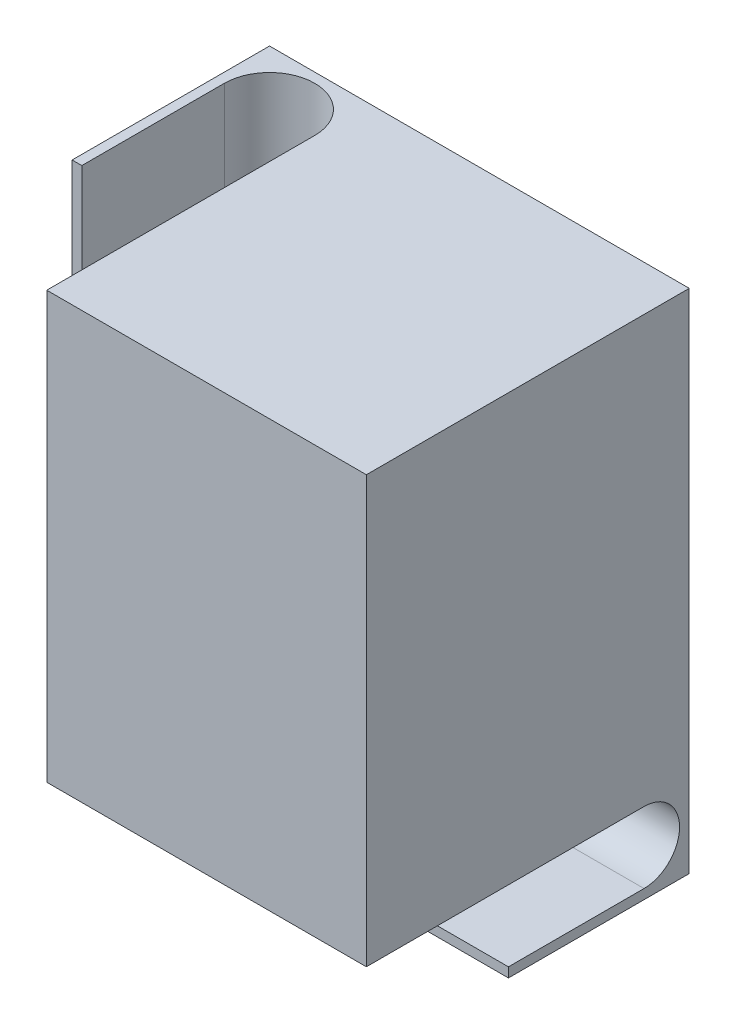
ISO-10303-21;
HEADER;
FILE_DESCRIPTION(('STEP AP214'),'2;1');
FILE_NAME('part.step','',(''),(''),'','','');
FILE_SCHEMA(('AUTOMOTIVE_DESIGN { 1 0 10303 214 1 1 1 1 }'));
ENDSEC;
DATA;
#1=APPLICATION_CONTEXT('core data for automotive mechanical design processes');
#2=APPLICATION_PROTOCOL_DEFINITION('international standard','automotive_design',2000,#1);
#3=PRODUCT_CONTEXT('',#1,'mechanical');
#4=PRODUCT('Part','Part','',(#3));
#5=PRODUCT_RELATED_PRODUCT_CATEGORY('part','',(#4));
#6=PRODUCT_DEFINITION_FORMATION('','',#4);
#7=PRODUCT_DEFINITION_CONTEXT('part definition',#1,'design');
#8=PRODUCT_DEFINITION('design','',#6,#7);
#9=PRODUCT_DEFINITION_SHAPE('','',#8);
#10=(LENGTH_UNIT() NAMED_UNIT(*) SI_UNIT(.MILLI.,.METRE.));
#11=(NAMED_UNIT(*) PLANE_ANGLE_UNIT() SI_UNIT($,.RADIAN.));
#12=(NAMED_UNIT(*) SI_UNIT($,.STERADIAN.) SOLID_ANGLE_UNIT());
#13=UNCERTAINTY_MEASURE_WITH_UNIT(LENGTH_MEASURE(1.E-05),#10,'distance_accuracy_value','');
#14=(GEOMETRIC_REPRESENTATION_CONTEXT(3) GLOBAL_UNCERTAINTY_ASSIGNED_CONTEXT((#13)) GLOBAL_UNIT_ASSIGNED_CONTEXT((#10,
#11,#12)) REPRESENTATION_CONTEXT('',''));
#15=CARTESIAN_POINT('',(0.,0.,0.));
#16=DIRECTION('',(0.,0.,1.));
#17=DIRECTION('',(1.,0.,0.));
#18=AXIS2_PLACEMENT_3D('',#15,#16,#17);
#19=CARTESIAN_POINT('',(-75.6600518235606,-86.1372549019608,14.));
#20=DIRECTION('',(1.,0.,0.));
#21=DIRECTION('',(0.,1.,0.));
#22=AXIS2_PLACEMENT_3D('',#19,#20,#21);
#23=CYLINDRICAL_SURFACE('',#22,11.);
#24=CARTESIAN_POINT('',(55.5098039215686,-86.1372549019608,14.));
#25=DIRECTION('',(1.,0.,0.));
#26=DIRECTION('',(0.,0.,-1.));
#27=AXIS2_PLACEMENT_3D('',#24,#25,#26);
#28=CIRCLE('',#27,11.);
#29=CARTESIAN_POINT('',(55.5098039215686,-75.1372549019608,14.));
#30=VERTEX_POINT('',#29);
#31=CARTESIAN_POINT('',(55.5098039215686,-86.1372549019608,3.));
#32=VERTEX_POINT('',#31);
#33=EDGE_CURVE('E245',#30,#32,#28,.F.);
#34=ORIENTED_EDGE('',*,*,#33,.T.);
#35=CARTESIAN_POINT('',(55.5098039215686,-97.1372549019608,14.));
#36=VERTEX_POINT('',#35);
#37=EDGE_CURVE('E241',#32,#36,#28,.F.);
#38=ORIENTED_EDGE('',*,*,#37,.T.);
#39=DIRECTION('',(1.,0.,0.));
#40=VECTOR('',#39,1.);
#41=CARTESIAN_POINT('',(-75.6600518235606,-97.1372549019608,14.));
#42=LINE('',#41,#40);
#43=CARTESIAN_POINT('',(154.509803921569,-97.1372549019608,14.));
#44=VERTEX_POINT('',#43);
#45=EDGE_CURVE('E303',#36,#44,#42,.T.);
#46=ORIENTED_EDGE('',*,*,#45,.T.);
#47=CARTESIAN_POINT('',(154.509803921569,-86.1372549019608,14.));
#48=DIRECTION('',(1.,0.,0.));
#49=DIRECTION('',(0.,1.,0.));
#50=AXIS2_PLACEMENT_3D('',#47,#48,#49);
#51=CIRCLE('',#50,11.);
#52=CARTESIAN_POINT('',(154.509803921569,-75.1372549019608,14.));
#53=VERTEX_POINT('',#52);
#54=EDGE_CURVE('E286',#44,#53,#51,.T.);
#55=ORIENTED_EDGE('',*,*,#54,.T.);
#56=DIRECTION('',(1.,0.,0.));
#57=VECTOR('',#56,1.);
#58=CARTESIAN_POINT('',(-75.6600518235606,-75.1372549019608,14.));
#59=LINE('',#58,#57);
#60=EDGE_CURVE('E302',#30,#53,#59,.T.);
#61=ORIENTED_EDGE('',*,*,#60,.F.);
#62=EDGE_LOOP('',(#34,#38,#46,#55,#61));
#63=FACE_BOUND('',#62,.T.);
#64=ADVANCED_FACE('F41',(#63),#23,.F.);
#65=CARTESIAN_POINT('',(-75.6600518235606,-97.1372549019608,14.));
#66=DIRECTION('',(0.,-1.,0.));
#67=DIRECTION('',(0.,0.,-1.));
#68=AXIS2_PLACEMENT_3D('',#65,#66,#67);
#69=PLANE('',#68);
#70=ORIENTED_EDGE('',*,*,#45,.F.);
#71=DIRECTION('',(0.,0.,1.));
#72=VECTOR('',#71,1.);
#73=CARTESIAN_POINT('',(55.5098039215686,-97.1372549019608,14.));
#74=LINE('',#73,#72);
#75=CARTESIAN_POINT('',(55.5098039215686,-97.1372549019608,56.));
#76=VERTEX_POINT('',#75);
#77=EDGE_CURVE('E282',#36,#76,#74,.T.);
#78=ORIENTED_EDGE('',*,*,#77,.T.);
#79=DIRECTION('',(1.,0.,0.));
#80=VECTOR('',#79,1.);
#81=CARTESIAN_POINT('',(-75.6600518235606,-97.1372549019608,56.));
#82=LINE('',#81,#80);
#83=CARTESIAN_POINT('',(154.509803921569,-97.1372549019608,56.));
#84=VERTEX_POINT('',#83);
#85=EDGE_CURVE('E307',#76,#84,#82,.T.);
#86=ORIENTED_EDGE('',*,*,#85,.T.);
#87=DIRECTION('',(0.,0.,-1.));
#88=VECTOR('',#87,1.);
#89=CARTESIAN_POINT('',(154.509803921569,-97.1372549019608,14.));
#90=LINE('',#89,#88);
#91=EDGE_CURVE('E298',#84,#44,#90,.T.);
#92=ORIENTED_EDGE('',*,*,#91,.T.);
#93=EDGE_LOOP('',(#70,#78,#86,#92));
#94=FACE_BOUND('',#93,.T.);
#95=ADVANCED_FACE('F443',(#94),#69,.F.);
#96=CARTESIAN_POINT('',(-75.6600518235606,-97.1372549019608,56.));
#97=DIRECTION('',(0.,0.,-1.));
#98=DIRECTION('',(-1.,0.,0.));
#99=AXIS2_PLACEMENT_3D('',#96,#97,#98);
#100=PLANE('',#99);
#101=ORIENTED_EDGE('',*,*,#85,.F.);
#102=DIRECTION('',(0.,-1.,0.));
#103=VECTOR('',#102,1.);
#104=CARTESIAN_POINT('',(55.5098039215686,-97.1372549019608,56.));
#105=LINE('',#104,#103);
#106=CARTESIAN_POINT('',(55.5098039215686,-100.137254901961,56.));
#107=VERTEX_POINT('',#106);
#108=EDGE_CURVE('E249',#76,#107,#105,.T.);
#109=ORIENTED_EDGE('',*,*,#108,.T.);
#110=DIRECTION('',(1.,0.,0.));
#111=VECTOR('',#110,1.);
#112=CARTESIAN_POINT('',(-75.6600518235606,-100.137254901961,56.));
#113=LINE('',#112,#111);
#114=CARTESIAN_POINT('',(154.509803921569,-100.137254901961,56.));
#115=VERTEX_POINT('',#114);
#116=EDGE_CURVE('E310',#107,#115,#113,.T.);
#117=ORIENTED_EDGE('',*,*,#116,.T.);
#118=DIRECTION('',(0.,1.,0.));
#119=VECTOR('',#118,1.);
#120=CARTESIAN_POINT('',(154.509803921569,-97.1372549019608,56.));
#121=LINE('',#120,#119);
#122=EDGE_CURVE('E294',#115,#84,#121,.T.);
#123=ORIENTED_EDGE('',*,*,#122,.T.);
#124=EDGE_LOOP('',(#101,#109,#117,#123));
#125=FACE_BOUND('',#124,.T.);
#126=ADVANCED_FACE('F448',(#125),#100,.F.);
#127=CARTESIAN_POINT('',(-75.6600518235606,-75.1372549019608,14.));
#128=DIRECTION('',(0.,1.,0.));
#129=DIRECTION('',(-1.,0.,0.));
#130=AXIS2_PLACEMENT_3D('',#127,#128,#129);
#131=PLANE('',#130);
#132=DIRECTION('',(0.,0.,-1.));
#133=VECTOR('',#132,1.);
#134=CARTESIAN_POINT('',(55.5098039215686,-75.1372549019608,14.));
#135=LINE('',#134,#133);
#136=CARTESIAN_POINT('',(55.5098039215686,-75.1372549019608,100.));
#137=VERTEX_POINT('',#136);
#138=CARTESIAN_POINT('',(55.5098039215686,-75.1372549019608,17.));
#139=VERTEX_POINT('',#138);
#140=EDGE_CURVE('E45',#137,#139,#135,.T.);
#141=ORIENTED_EDGE('',*,*,#140,.T.);
#142=CARTESIAN_POINT('',(41.5098039215686,-75.1372549019608,17.));
#143=DIRECTION('',(0.,1.,0.));
#144=DIRECTION('',(-1.,0.,0.));
#145=AXIS2_PLACEMENT_3D('',#142,#143,#144);
#146=CIRCLE('',#145,14.);
#147=CARTESIAN_POINT('',(41.5098039215686,-75.1372549019608,3.00000000000001));
#148=VERTEX_POINT('',#147);
#149=EDGE_CURVE('E12',#139,#148,#146,.T.);
#150=ORIENTED_EDGE('',*,*,#149,.T.);
#151=DIRECTION('',(1.,0.,0.));
#152=VECTOR('',#151,1.);
#153=CARTESIAN_POINT('',(55.5098039215686,-75.1372549019608,3.));
#154=LINE('',#153,#152);
#155=CARTESIAN_POINT('',(55.5098039215686,-75.1372549019608,3.));
#156=VERTEX_POINT('',#155);
#157=EDGE_CURVE('E224',#148,#156,#154,.T.);
#158=ORIENTED_EDGE('',*,*,#157,.T.);
#159=DIRECTION('',(0.,0.,1.));
#160=VECTOR('',#159,1.);
#161=CARTESIAN_POINT('',(55.5098039215686,-75.1372549019608,61.1392223781047));
#162=LINE('',#161,#160);
#163=EDGE_CURVE('E230',#156,#30,#162,.T.);
#164=ORIENTED_EDGE('',*,*,#163,.T.);
#165=ORIENTED_EDGE('',*,*,#60,.T.);
#166=DIRECTION('',(0.,0.,1.));
#167=VECTOR('',#166,1.);
#168=CARTESIAN_POINT('',(154.509803921569,-75.1372549019608,14.));
#169=LINE('',#168,#167);
#170=CARTESIAN_POINT('',(154.509803921569,-75.1372549019608,100.));
#171=VERTEX_POINT('',#170);
#172=EDGE_CURVE('E290',#53,#171,#169,.T.);
#173=ORIENTED_EDGE('',*,*,#172,.T.);
#174=DIRECTION('',(1.,0.,0.));
#175=VECTOR('',#174,1.);
#176=CARTESIAN_POINT('',(-75.6600518235606,-75.1372549019608,100.));
#177=LINE('',#176,#175);
#178=EDGE_CURVE('E313',#137,#171,#177,.T.);
#179=ORIENTED_EDGE('',*,*,#178,.F.);
#180=EDGE_LOOP('',(#141,#150,#158,#164,#165,#173,#179));
#181=FACE_BOUND('',#180,.T.);
#182=ADVANCED_FACE('F369',(#181),#131,.F.);
#183=CARTESIAN_POINT('',(24.5098039215686,56.8627450980392,100.));
#184=DIRECTION('',(1.,0.,0.));
#185=DIRECTION('',(0.,1.,0.));
#186=AXIS2_PLACEMENT_3D('',#183,#184,#185);
#187=PLANE('',#186);
#188=DIRECTION('',(0.,-1.,0.));
#189=VECTOR('',#188,1.);
#190=CARTESIAN_POINT('',(24.5098039215686,-9.24970540487664,3.00000000000001));
#191=LINE('',#190,#189);
#192=CARTESIAN_POINT('',(24.5098039215686,-75.1372549019608,3.00000000000001));
#193=VERTEX_POINT('',#192);
#194=CARTESIAN_POINT('',(24.5098039215686,-100.137254901961,3.00000000000001));
#195=VERTEX_POINT('',#194);
#196=EDGE_CURVE('E234',#193,#195,#191,.T.);
#197=ORIENTED_EDGE('',*,*,#196,.F.);
#198=DIRECTION('',(0.,0.,-1.));
#199=VECTOR('',#198,1.);
#200=CARTESIAN_POINT('',(24.5098039215686,-75.1372549019608,14.));
#201=LINE('',#200,#199);
#202=CARTESIAN_POINT('',(24.5098039215686,-75.1372549019608,61.1392223781047));
#203=VERTEX_POINT('',#202);
#204=EDGE_CURVE('E306',#203,#193,#201,.T.);
#205=ORIENTED_EDGE('',*,*,#204,.F.);
#206=DIRECTION('',(0.,1.,0.));
#207=VECTOR('',#206,1.);
#208=CARTESIAN_POINT('',(24.5098039215686,-201.970451846769,61.1392223781047));
#209=LINE('',#208,#207);
#210=CARTESIAN_POINT('',(24.5098039215686,56.8627450980392,61.1392223781047));
#211=VERTEX_POINT('',#210);
#212=EDGE_CURVE('E271',#203,#211,#209,.T.);
#213=ORIENTED_EDGE('',*,*,#212,.T.);
#214=DIRECTION('',(0.,0.,-1.));
#215=VECTOR('',#214,1.);
#216=CARTESIAN_POINT('',(24.5098039215686,56.8627450980392,100.));
#217=LINE('',#216,#215);
#218=CARTESIAN_POINT('',(24.5098039215686,56.8627450980392,0.));
#219=VERTEX_POINT('',#218);
#220=EDGE_CURVE('E329',#211,#219,#217,.T.);
#221=ORIENTED_EDGE('',*,*,#220,.T.);
#222=DIRECTION('',(0.,-1.,0.));
#223=VECTOR('',#222,1.);
#224=CARTESIAN_POINT('',(24.5098039215686,56.8627450980392,0.));
#225=LINE('',#224,#223);
#226=CARTESIAN_POINT('',(24.5098039215686,-100.137254901961,0.));
#227=VERTEX_POINT('',#226);
#228=EDGE_CURVE('E320',#219,#227,#225,.T.);
#229=ORIENTED_EDGE('',*,*,#228,.T.);
#230=DIRECTION('',(0.,0.,-1.));
#231=VECTOR('',#230,1.);
#232=CARTESIAN_POINT('',(24.5098039215686,-100.137254901961,100.));
#233=LINE('',#232,#231);
#234=EDGE_CURVE('E352',#195,#227,#233,.T.);
#235=ORIENTED_EDGE('',*,*,#234,.F.);
#236=EDGE_LOOP('',(#197,#205,#213,#221,#229,#235));
#237=FACE_BOUND('',#236,.T.);
#238=ADVANCED_FACE('F43',(#237),#187,.F.);
#239=CARTESIAN_POINT('',(24.5098039215686,-100.137254901961,100.));
#240=DIRECTION('',(0.,1.,0.));
#241=DIRECTION('',(0.,0.,1.));
#242=AXIS2_PLACEMENT_3D('',#239,#240,#241);
#243=PLANE('',#242);
#244=DIRECTION('',(0.,0.,1.));
#245=VECTOR('',#244,1.);
#246=CARTESIAN_POINT('',(55.5098039215686,-100.137254901961,17.));
#247=LINE('',#246,#245);
#248=CARTESIAN_POINT('',(55.5098039215686,-100.137254901961,3.));
#249=VERTEX_POINT('',#248);
#250=EDGE_CURVE('E246',#249,#107,#247,.T.);
#251=ORIENTED_EDGE('',*,*,#250,.F.);
#252=DIRECTION('',(1.,0.,0.));
#253=VECTOR('',#252,1.);
#254=CARTESIAN_POINT('',(55.5098039215686,-100.137254901961,3.));
#255=LINE('',#254,#253);
#256=EDGE_CURVE('E221',#195,#249,#255,.T.);
#257=ORIENTED_EDGE('',*,*,#256,.F.);
#258=ORIENTED_EDGE('',*,*,#234,.T.);
#259=DIRECTION('',(1.,0.,0.));
#260=VECTOR('',#259,1.);
#261=CARTESIAN_POINT('',(24.5098039215686,-100.137254901961,0.));
#262=LINE('',#261,#260);
#263=CARTESIAN_POINT('',(154.509803921569,-100.137254901961,0.));
#264=VERTEX_POINT('',#263);
#265=EDGE_CURVE('E333',#227,#264,#262,.T.);
#266=ORIENTED_EDGE('',*,*,#265,.T.);
#267=DIRECTION('',(0.,0.,-1.));
#268=VECTOR('',#267,1.);
#269=CARTESIAN_POINT('',(154.509803921569,-100.137254901961,100.));
#270=LINE('',#269,#268);
#271=EDGE_CURVE('E349',#115,#264,#270,.T.);
#272=ORIENTED_EDGE('',*,*,#271,.F.);
#273=ORIENTED_EDGE('',*,*,#116,.F.);
#274=EDGE_LOOP('',(#251,#257,#258,#266,#272,#273));
#275=FACE_BOUND('',#274,.T.);
#276=ADVANCED_FACE('F401',(#275),#243,.F.);
#277=CARTESIAN_POINT('',(154.509803921569,56.8627450980392,100.));
#278=DIRECTION('',(-1.,0.,0.));
#279=DIRECTION('',(0.,-1.,0.));
#280=AXIS2_PLACEMENT_3D('',#277,#278,#279);
#281=PLANE('',#280);
#282=ORIENTED_EDGE('',*,*,#91,.F.);
#283=ORIENTED_EDGE('',*,*,#122,.F.);
#284=ORIENTED_EDGE('',*,*,#271,.T.);
#285=DIRECTION('',(0.,1.,0.));
#286=VECTOR('',#285,1.);
#287=CARTESIAN_POINT('',(154.509803921569,56.8627450980392,0.));
#288=LINE('',#287,#286);
#289=CARTESIAN_POINT('',(154.509803921569,56.8627450980392,0.));
#290=VERTEX_POINT('',#289);
#291=EDGE_CURVE('E337',#264,#290,#288,.T.);
#292=ORIENTED_EDGE('',*,*,#291,.T.);
#293=DIRECTION('',(0.,0.,-1.));
#294=VECTOR('',#293,1.);
#295=CARTESIAN_POINT('',(154.509803921569,56.8627450980392,100.));
#296=LINE('',#295,#294);
#297=CARTESIAN_POINT('',(154.509803921569,56.8627450980392,100.));
#298=VERTEX_POINT('',#297);
#299=EDGE_CURVE('E345',#298,#290,#296,.T.);
#300=ORIENTED_EDGE('',*,*,#299,.F.);
#301=DIRECTION('',(0.,1.,0.));
#302=VECTOR('',#301,1.);
#303=CARTESIAN_POINT('',(154.509803921569,56.8627450980392,100.));
#304=LINE('',#303,#302);
#305=EDGE_CURVE('E321',#171,#298,#304,.T.);
#306=ORIENTED_EDGE('',*,*,#305,.F.);
#307=ORIENTED_EDGE('',*,*,#172,.F.);
#308=ORIENTED_EDGE('',*,*,#54,.F.);
#309=EDGE_LOOP('',(#282,#283,#284,#292,#300,#306,#307,#308));
#310=FACE_BOUND('',#309,.T.);
#311=ADVANCED_FACE('F424',(#310),#281,.F.);
#312=CARTESIAN_POINT('',(24.5098039215686,56.8627450980392,100.));
#313=DIRECTION('',(0.,-1.,0.));
#314=DIRECTION('',(0.,0.,-1.));
#315=AXIS2_PLACEMENT_3D('',#312,#313,#314);
#316=PLANE('',#315);
#317=CARTESIAN_POINT('',(41.5098039215686,56.8627450980392,17.));
#318=DIRECTION('',(0.,1.,0.));
#319=DIRECTION('',(0.,0.,1.));
#320=AXIS2_PLACEMENT_3D('',#317,#318,#319);
#321=CIRCLE('',#320,14.);
#322=CARTESIAN_POINT('',(55.5098039215686,56.8627450980392,17.));
#323=VERTEX_POINT('',#322);
#324=CARTESIAN_POINT('',(27.5098039215686,56.8627450980392,17.));
#325=VERTEX_POINT('',#324);
#326=EDGE_CURVE('E251',#323,#325,#321,.T.);
#327=ORIENTED_EDGE('',*,*,#326,.F.);
#328=DIRECTION('',(0.,0.,-1.));
#329=VECTOR('',#328,1.);
#330=CARTESIAN_POINT('',(55.5098039215686,56.8627450980392,17.));
#331=LINE('',#330,#329);
#332=CARTESIAN_POINT('',(55.5098039215686,56.8627450980392,100.));
#333=VERTEX_POINT('',#332);
#334=EDGE_CURVE('E261',#333,#323,#331,.T.);
#335=ORIENTED_EDGE('',*,*,#334,.F.);
#336=DIRECTION('',(-1.,0.,0.));
#337=VECTOR('',#336,1.);
#338=CARTESIAN_POINT('',(24.5098039215686,56.8627450980392,100.));
#339=LINE('',#338,#337);
#340=EDGE_CURVE('E324',#298,#333,#339,.T.);
#341=ORIENTED_EDGE('',*,*,#340,.F.);
#342=ORIENTED_EDGE('',*,*,#299,.T.);
#343=DIRECTION('',(-1.,0.,0.));
#344=VECTOR('',#343,1.);
#345=CARTESIAN_POINT('',(24.5098039215686,56.8627450980392,0.));
#346=LINE('',#345,#344);
#347=EDGE_CURVE('E325',#290,#219,#346,.T.);
#348=ORIENTED_EDGE('',*,*,#347,.T.);
#349=ORIENTED_EDGE('',*,*,#220,.F.);
#350=DIRECTION('',(-1.,0.,0.));
#351=VECTOR('',#350,1.);
#352=CARTESIAN_POINT('',(27.5098039215686,56.8627450980392,61.1392223781047));
#353=LINE('',#352,#351);
#354=CARTESIAN_POINT('',(27.5098039215686,56.8627450980392,61.1392223781047));
#355=VERTEX_POINT('',#354);
#356=EDGE_CURVE('E258',#355,#211,#353,.T.);
#357=ORIENTED_EDGE('',*,*,#356,.F.);
#358=DIRECTION('',(0.,0.,1.));
#359=VECTOR('',#358,1.);
#360=CARTESIAN_POINT('',(27.5098039215686,56.8627450980392,17.));
#361=LINE('',#360,#359);
#362=EDGE_CURVE('E255',#325,#355,#361,.T.);
#363=ORIENTED_EDGE('',*,*,#362,.F.);
#364=EDGE_LOOP('',(#327,#335,#341,#342,#348,#349,#357,#363));
#365=FACE_BOUND('',#364,.T.);
#366=ADVANCED_FACE('F383',(#365),#316,.F.);
#367=CARTESIAN_POINT('',(0.,0.,100.));
#368=DIRECTION('',(0.,0.,1.));
#369=DIRECTION('',(1.,0.,0.));
#370=AXIS2_PLACEMENT_3D('',#367,#368,#369);
#371=PLANE('',#370);
#372=DIRECTION('',(0.,1.,0.));
#373=VECTOR('',#372,1.);
#374=CARTESIAN_POINT('',(55.5098039215686,-201.970451846769,100.));
#375=LINE('',#374,#373);
#376=EDGE_CURVE('E268',#137,#333,#375,.T.);
#377=ORIENTED_EDGE('',*,*,#376,.F.);
#378=ORIENTED_EDGE('',*,*,#178,.T.);
#379=ORIENTED_EDGE('',*,*,#305,.T.);
#380=ORIENTED_EDGE('',*,*,#340,.T.);
#381=EDGE_LOOP('',(#377,#378,#379,#380));
#382=FACE_BOUND('',#381,.T.);
#383=ADVANCED_FACE('F426',(#382),#371,.T.);
#384=CARTESIAN_POINT('',(0.,0.,0.));
#385=DIRECTION('',(0.,0.,1.));
#386=DIRECTION('',(1.,0.,0.));
#387=AXIS2_PLACEMENT_3D('',#384,#385,#386);
#388=PLANE('',#387);
#389=DIRECTION('',(0.,1.,0.));
#390=VECTOR('',#389,1.);
#391=CARTESIAN_POINT('',(58.5098039215686,53.8627450980392,0.));
#392=LINE('',#391,#390);
#393=CARTESIAN_POINT('',(58.5098039215686,-72.1372549019608,0.));
#394=VERTEX_POINT('',#393);
#395=CARTESIAN_POINT('',(58.5098039215686,53.8627450980392,0.));
#396=VERTEX_POINT('',#395);
#397=EDGE_CURVE('E202',#394,#396,#392,.T.);
#398=ORIENTED_EDGE('',*,*,#397,.F.);
#399=DIRECTION('',(-1.,0.,0.));
#400=VECTOR('',#399,1.);
#401=CARTESIAN_POINT('',(151.509803921569,-72.1372549019608,0.));
#402=LINE('',#401,#400);
#403=CARTESIAN_POINT('',(151.509803921569,-72.1372549019608,0.));
#404=VERTEX_POINT('',#403);
#405=EDGE_CURVE('E192',#404,#394,#402,.T.);
#406=ORIENTED_EDGE('',*,*,#405,.F.);
#407=DIRECTION('',(0.,-1.,0.));
#408=VECTOR('',#407,1.);
#409=CARTESIAN_POINT('',(151.509803921569,53.8627450980392,0.));
#410=LINE('',#409,#408);
#411=CARTESIAN_POINT('',(151.509803921569,53.8627450980392,0.));
#412=VERTEX_POINT('',#411);
#413=EDGE_CURVE('E206',#412,#404,#410,.T.);
#414=ORIENTED_EDGE('',*,*,#413,.F.);
#415=DIRECTION('',(1.,0.,0.));
#416=VECTOR('',#415,1.);
#417=CARTESIAN_POINT('',(151.509803921569,53.8627450980392,0.));
#418=LINE('',#417,#416);
#419=EDGE_CURVE('E58',#396,#412,#418,.T.);
#420=ORIENTED_EDGE('',*,*,#419,.F.);
#421=EDGE_LOOP('',(#398,#406,#414,#420));
#422=FACE_BOUND('',#421,.T.);
#423=ORIENTED_EDGE('',*,*,#228,.F.);
#424=ORIENTED_EDGE('',*,*,#347,.F.);
#425=ORIENTED_EDGE('',*,*,#291,.F.);
#426=ORIENTED_EDGE('',*,*,#265,.F.);
#427=EDGE_LOOP('',(#423,#424,#425,#426));
#428=FACE_BOUND('',#427,.T.);
#429=ADVANCED_FACE('F431',(#422,#428),#388,.F.);
#430=ORIENTED_EDGE('',*,*,#204,.T.);
#431=EDGE_CURVE('E225',#193,#148,#154,.T.);
#432=ORIENTED_EDGE('',*,*,#431,.T.);
#433=CARTESIAN_POINT('',(27.5098039215686,-75.1372549019608,17.));
#434=VERTEX_POINT('',#433);
#435=EDGE_CURVE('E51',#148,#434,#146,.T.);
#436=ORIENTED_EDGE('',*,*,#435,.T.);
#437=DIRECTION('',(0.,0.,1.));
#438=VECTOR('',#437,1.);
#439=CARTESIAN_POINT('',(27.5098039215686,-75.1372549019608,14.));
#440=LINE('',#439,#438);
#441=CARTESIAN_POINT('',(27.5098039215686,-75.1372549019608,61.1392223781047));
#442=VERTEX_POINT('',#441);
#443=EDGE_CURVE('E355',#434,#442,#440,.T.);
#444=ORIENTED_EDGE('',*,*,#443,.T.);
#445=DIRECTION('',(-1.,0.,0.));
#446=VECTOR('',#445,1.);
#447=CARTESIAN_POINT('',(-75.6600518235606,-75.1372549019608,61.1392223781047));
#448=LINE('',#447,#446);
#449=EDGE_CURVE('E359',#442,#203,#448,.T.);
#450=ORIENTED_EDGE('',*,*,#449,.T.);
#451=EDGE_LOOP('',(#430,#432,#436,#444,#450));
#452=FACE_BOUND('',#451,.T.);
#453=ADVANCED_FACE('F386',(#452),#131,.F.);
#454=CARTESIAN_POINT('',(55.5098039215686,-201.970451846769,17.));
#455=DIRECTION('',(1.,0.,0.));
#456=DIRECTION('',(0.,0.,-1.));
#457=AXIS2_PLACEMENT_3D('',#454,#455,#456);
#458=PLANE('',#457);
#459=ORIENTED_EDGE('',*,*,#376,.T.);
#460=ORIENTED_EDGE('',*,*,#334,.T.);
#461=DIRECTION('',(0.,1.,0.));
#462=VECTOR('',#461,1.);
#463=CARTESIAN_POINT('',(55.5098039215686,-201.970451846769,17.));
#464=LINE('',#463,#462);
#465=EDGE_CURVE('E250',#139,#323,#464,.T.);
#466=ORIENTED_EDGE('',*,*,#465,.F.);
#467=ORIENTED_EDGE('',*,*,#140,.F.);
#468=EDGE_LOOP('',(#459,#460,#466,#467));
#469=FACE_BOUND('',#468,.T.);
#470=ADVANCED_FACE('F377',(#469),#458,.F.);
#471=CARTESIAN_POINT('',(27.5098039215686,-201.970451846769,17.));
#472=DIRECTION('',(-1.,0.,0.));
#473=DIRECTION('',(0.,0.,1.));
#474=AXIS2_PLACEMENT_3D('',#471,#472,#473);
#475=PLANE('',#474);
#476=DIRECTION('',(0.,1.,0.));
#477=VECTOR('',#476,1.);
#478=CARTESIAN_POINT('',(27.5098039215686,-201.970451846769,17.));
#479=LINE('',#478,#477);
#480=EDGE_CURVE('E265',#434,#325,#479,.T.);
#481=ORIENTED_EDGE('',*,*,#480,.T.);
#482=ORIENTED_EDGE('',*,*,#362,.T.);
#483=DIRECTION('',(0.,1.,0.));
#484=VECTOR('',#483,1.);
#485=CARTESIAN_POINT('',(27.5098039215686,-201.970451846769,61.1392223781047));
#486=LINE('',#485,#484);
#487=EDGE_CURVE('E66',#442,#355,#486,.T.);
#488=ORIENTED_EDGE('',*,*,#487,.F.);
#489=ORIENTED_EDGE('',*,*,#443,.F.);
#490=EDGE_LOOP('',(#481,#482,#488,#489));
#491=FACE_BOUND('',#490,.T.);
#492=ADVANCED_FACE('F385',(#491),#475,.F.);
#493=CARTESIAN_POINT('',(27.5098039215686,-201.970451846769,61.1392223781047));
#494=DIRECTION('',(0.,0.,-1.));
#495=DIRECTION('',(-1.,0.,0.));
#496=AXIS2_PLACEMENT_3D('',#493,#494,#495);
#497=PLANE('',#496);
#498=ORIENTED_EDGE('',*,*,#487,.T.);
#499=ORIENTED_EDGE('',*,*,#356,.T.);
#500=ORIENTED_EDGE('',*,*,#212,.F.);
#501=ORIENTED_EDGE('',*,*,#449,.F.);
#502=EDGE_LOOP('',(#498,#499,#500,#501));
#503=FACE_BOUND('',#502,.T.);
#504=ADVANCED_FACE('F432',(#503),#497,.F.);
#505=CARTESIAN_POINT('',(41.5098039215686,-201.970451846769,17.));
#506=DIRECTION('',(0.,1.,0.));
#507=DIRECTION('',(0.,0.,1.));
#508=AXIS2_PLACEMENT_3D('',#505,#506,#507);
#509=CYLINDRICAL_SURFACE('',#508,14.);
#510=ORIENTED_EDGE('',*,*,#435,.F.);
#511=ORIENTED_EDGE('',*,*,#149,.F.);
#512=ORIENTED_EDGE('',*,*,#465,.T.);
#513=ORIENTED_EDGE('',*,*,#326,.T.);
#514=ORIENTED_EDGE('',*,*,#480,.F.);
#515=EDGE_LOOP('',(#510,#511,#512,#513,#514));
#516=FACE_BOUND('',#515,.T.);
#517=ADVANCED_FACE('F375',(#516),#509,.F.);
#518=ORIENTED_EDGE('',*,*,#77,.F.);
#519=ORIENTED_EDGE('',*,*,#37,.F.);
#520=DIRECTION('',(0.,-1.,0.));
#521=VECTOR('',#520,1.);
#522=CARTESIAN_POINT('',(55.5098039215686,-9.24970540487664,3.));
#523=LINE('',#522,#521);
#524=EDGE_CURVE('E229',#32,#249,#523,.T.);
#525=ORIENTED_EDGE('',*,*,#524,.T.);
#526=ORIENTED_EDGE('',*,*,#250,.T.);
#527=ORIENTED_EDGE('',*,*,#108,.F.);
#528=EDGE_LOOP('',(#518,#519,#525,#526,#527));
#529=FACE_BOUND('',#528,.T.);
#530=ADVANCED_FACE('F407',(#529),#458,.F.);
#531=CARTESIAN_POINT('',(55.5098039215686,-9.24970540487664,3.));
#532=DIRECTION('',(0.,0.,-1.));
#533=DIRECTION('',(-1.,0.,0.));
#534=AXIS2_PLACEMENT_3D('',#531,#532,#533);
#535=PLANE('',#534);
#536=EDGE_CURVE('E235',#156,#32,#523,.T.);
#537=ORIENTED_EDGE('',*,*,#536,.F.);
#538=ORIENTED_EDGE('',*,*,#157,.F.);
#539=ORIENTED_EDGE('',*,*,#431,.F.);
#540=ORIENTED_EDGE('',*,*,#196,.T.);
#541=ORIENTED_EDGE('',*,*,#256,.T.);
#542=ORIENTED_EDGE('',*,*,#524,.F.);
#543=EDGE_LOOP('',(#537,#538,#539,#540,#541,#542));
#544=FACE_BOUND('',#543,.T.);
#545=ADVANCED_FACE('F397',(#544),#535,.F.);
#546=CARTESIAN_POINT('',(55.5098039215686,-9.24970540487664,61.1392223781047));
#547=DIRECTION('',(1.,0.,0.));
#548=DIRECTION('',(0.,0.,-1.));
#549=AXIS2_PLACEMENT_3D('',#546,#547,#548);
#550=PLANE('',#549);
#551=ORIENTED_EDGE('',*,*,#163,.F.);
#552=ORIENTED_EDGE('',*,*,#536,.T.);
#553=ORIENTED_EDGE('',*,*,#33,.F.);
#554=EDGE_LOOP('',(#551,#552,#553));
#555=FACE_BOUND('',#554,.T.);
#556=ADVANCED_FACE('F413',(#555),#550,.F.);
#557=CARTESIAN_POINT('',(0.,0.,97.));
#558=DIRECTION('',(0.,0.,1.));
#559=DIRECTION('',(1.,0.,0.));
#560=AXIS2_PLACEMENT_3D('',#557,#558,#559);
#561=PLANE('',#560);
#562=DIRECTION('',(0.,-1.,0.));
#563=VECTOR('',#562,1.);
#564=CARTESIAN_POINT('',(151.509803921569,53.8627450980392,97.));
#565=LINE('',#564,#563);
#566=CARTESIAN_POINT('',(151.509803921569,53.8627450980392,97.));
#567=VERTEX_POINT('',#566);
#568=CARTESIAN_POINT('',(151.509803921569,-72.1372549019608,97.));
#569=VERTEX_POINT('',#568);
#570=EDGE_CURVE('E197',#567,#569,#565,.T.);
#571=ORIENTED_EDGE('',*,*,#570,.T.);
#572=DIRECTION('',(-1.,0.,0.));
#573=VECTOR('',#572,1.);
#574=CARTESIAN_POINT('',(151.509803921569,-72.1372549019608,97.));
#575=LINE('',#574,#573);
#576=CARTESIAN_POINT('',(58.5098039215686,-72.1372549019608,97.));
#577=VERTEX_POINT('',#576);
#578=EDGE_CURVE('E189',#569,#577,#575,.T.);
#579=ORIENTED_EDGE('',*,*,#578,.T.);
#580=DIRECTION('',(0.,1.,0.));
#581=VECTOR('',#580,1.);
#582=CARTESIAN_POINT('',(58.5098039215686,53.8627450980392,97.));
#583=LINE('',#582,#581);
#584=CARTESIAN_POINT('',(58.5098039215686,53.8627450980392,97.));
#585=VERTEX_POINT('',#584);
#586=EDGE_CURVE('E175',#577,#585,#583,.T.);
#587=ORIENTED_EDGE('',*,*,#586,.T.);
#588=DIRECTION('',(1.,0.,0.));
#589=VECTOR('',#588,1.);
#590=CARTESIAN_POINT('',(151.509803921569,53.8627450980392,97.));
#591=LINE('',#590,#589);
#592=EDGE_CURVE('E212',#585,#567,#591,.T.);
#593=ORIENTED_EDGE('',*,*,#592,.T.);
#594=EDGE_LOOP('',(#571,#579,#587,#593));
#595=FACE_BOUND('',#594,.T.);
#596=ADVANCED_FACE('F196',(#595),#561,.F.);
#597=CARTESIAN_POINT('',(151.509803921569,-72.1372549019608,256.604597633658));
#598=DIRECTION('',(0.,-1.,0.));
#599=DIRECTION('',(0.,0.,-1.));
#600=AXIS2_PLACEMENT_3D('',#597,#598,#599);
#601=PLANE('',#600);
#602=DIRECTION('',(0.,0.,-1.));
#603=VECTOR('',#602,1.);
#604=CARTESIAN_POINT('',(151.509803921569,-72.1372549019608,256.604597633658));
#605=LINE('',#604,#603);
#606=EDGE_CURVE('E210',#569,#404,#605,.T.);
#607=ORIENTED_EDGE('',*,*,#606,.T.);
#608=ORIENTED_EDGE('',*,*,#405,.T.);
#609=DIRECTION('',(0.,0.,-1.));
#610=VECTOR('',#609,1.);
#611=CARTESIAN_POINT('',(58.5098039215686,-72.1372549019608,256.604597633658));
#612=LINE('',#611,#610);
#613=EDGE_CURVE('E179',#577,#394,#612,.T.);
#614=ORIENTED_EDGE('',*,*,#613,.F.);
#615=ORIENTED_EDGE('',*,*,#578,.F.);
#616=EDGE_LOOP('',(#607,#608,#614,#615));
#617=FACE_BOUND('',#616,.T.);
#618=ADVANCED_FACE('F188',(#617),#601,.F.);
#619=CARTESIAN_POINT('',(58.5098039215686,53.8627450980392,256.604597633658));
#620=DIRECTION('',(-1.,0.,0.));
#621=DIRECTION('',(0.,-1.,0.));
#622=AXIS2_PLACEMENT_3D('',#619,#620,#621);
#623=PLANE('',#622);
#624=ORIENTED_EDGE('',*,*,#613,.T.);
#625=ORIENTED_EDGE('',*,*,#397,.T.);
#626=DIRECTION('',(0.,0.,-1.));
#627=VECTOR('',#626,1.);
#628=CARTESIAN_POINT('',(58.5098039215686,53.8627450980392,256.604597633658));
#629=LINE('',#628,#627);
#630=EDGE_CURVE('E181',#585,#396,#629,.T.);
#631=ORIENTED_EDGE('',*,*,#630,.F.);
#632=ORIENTED_EDGE('',*,*,#586,.F.);
#633=EDGE_LOOP('',(#624,#625,#631,#632));
#634=FACE_BOUND('',#633,.T.);
#635=ADVANCED_FACE('F177',(#634),#623,.F.);
#636=CARTESIAN_POINT('',(151.509803921569,53.8627450980392,256.604597633658));
#637=DIRECTION('',(0.,1.,0.));
#638=DIRECTION('',(0.,0.,1.));
#639=AXIS2_PLACEMENT_3D('',#636,#637,#638);
#640=PLANE('',#639);
#641=ORIENTED_EDGE('',*,*,#630,.T.);
#642=ORIENTED_EDGE('',*,*,#419,.T.);
#643=DIRECTION('',(0.,0.,-1.));
#644=VECTOR('',#643,1.);
#645=CARTESIAN_POINT('',(151.509803921569,53.8627450980392,256.604597633658));
#646=LINE('',#645,#644);
#647=EDGE_CURVE('E211',#567,#412,#646,.T.);
#648=ORIENTED_EDGE('',*,*,#647,.F.);
#649=ORIENTED_EDGE('',*,*,#592,.F.);
#650=EDGE_LOOP('',(#641,#642,#648,#649));
#651=FACE_BOUND('',#650,.T.);
#652=ADVANCED_FACE('F495',(#651),#640,.F.);
#653=CARTESIAN_POINT('',(151.509803921569,53.8627450980392,256.604597633658));
#654=DIRECTION('',(1.,0.,0.));
#655=DIRECTION('',(0.,1.,0.));
#656=AXIS2_PLACEMENT_3D('',#653,#654,#655);
#657=PLANE('',#656);
#658=ORIENTED_EDGE('',*,*,#647,.T.);
#659=ORIENTED_EDGE('',*,*,#413,.T.);
#660=ORIENTED_EDGE('',*,*,#606,.F.);
#661=ORIENTED_EDGE('',*,*,#570,.F.);
#662=EDGE_LOOP('',(#658,#659,#660,#661));
#663=FACE_BOUND('',#662,.T.);
#664=ADVANCED_FACE('F498',(#663),#657,.F.);
#665=CLOSED_SHELL('',(#64,#95,#126,#182,#238,#276,#311,#366,#383,#429,#453,#470,#492,#504,#517,
#530,#545,#556,#596,#618,#635,#652,#664));
#666=MANIFOLD_SOLID_BREP('B2',#665);
#667=ADVANCED_BREP_SHAPE_REPRESENTATION('',(#18,#666),#14);
#668=SHAPE_DEFINITION_REPRESENTATION(#9,#667);
ENDSEC;
END-ISO-10303-21;
